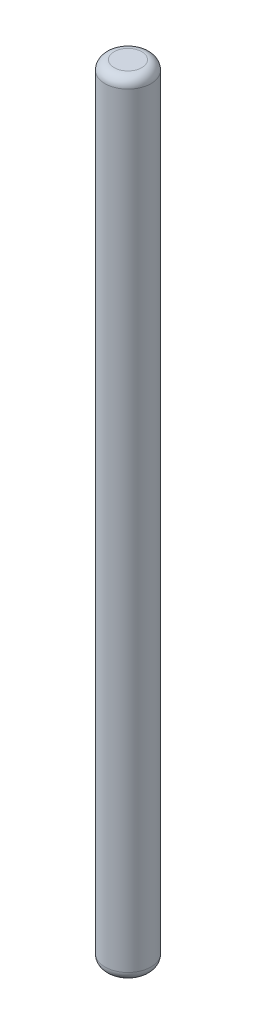
ISO-10303-21;
HEADER;
FILE_DESCRIPTION(('STEP AP214'),'2;1');
FILE_NAME('part.step','',(''),(''),'','','');
FILE_SCHEMA(('AUTOMOTIVE_DESIGN { 1 0 10303 214 1 1 1 1 }'));
ENDSEC;
DATA;
#1=APPLICATION_CONTEXT('core data for automotive mechanical design processes');
#2=APPLICATION_PROTOCOL_DEFINITION('international standard','automotive_design',2000,#1);
#3=PRODUCT_CONTEXT('',#1,'mechanical');
#4=PRODUCT('Part','Part','',(#3));
#5=PRODUCT_RELATED_PRODUCT_CATEGORY('part','',(#4));
#6=PRODUCT_DEFINITION_FORMATION('','',#4);
#7=PRODUCT_DEFINITION_CONTEXT('part definition',#1,'design');
#8=PRODUCT_DEFINITION('design','',#6,#7);
#9=PRODUCT_DEFINITION_SHAPE('','',#8);
#10=(LENGTH_UNIT() NAMED_UNIT(*) SI_UNIT(.MILLI.,.METRE.));
#11=(NAMED_UNIT(*) PLANE_ANGLE_UNIT() SI_UNIT($,.RADIAN.));
#12=(NAMED_UNIT(*) SI_UNIT($,.STERADIAN.) SOLID_ANGLE_UNIT());
#13=UNCERTAINTY_MEASURE_WITH_UNIT(LENGTH_MEASURE(1.E-05),#10,'distance_accuracy_value','');
#14=(GEOMETRIC_REPRESENTATION_CONTEXT(3) GLOBAL_UNCERTAINTY_ASSIGNED_CONTEXT((#13)) GLOBAL_UNIT_ASSIGNED_CONTEXT((#10,
#11,#12)) REPRESENTATION_CONTEXT('',''));
#15=CARTESIAN_POINT('',(0.,0.,0.));
#16=DIRECTION('',(0.,0.,1.));
#17=DIRECTION('',(1.,0.,0.));
#18=AXIS2_PLACEMENT_3D('',#15,#16,#17);
#19=CARTESIAN_POINT('',(0.0610619421206054,85.,-0.0610619421206095));
#20=DIRECTION('',(0.,-1.,0.));
#21=DIRECTION('',(0.,0.,-1.));
#22=AXIS2_PLACEMENT_3D('',#19,#20,#21);
#23=CYLINDRICAL_SURFACE('',#22,2.5);
#24=CARTESIAN_POINT('',(0.0610619421206054,1.,-0.0610619421206095));
#25=DIRECTION('',(0.,1.,0.));
#26=DIRECTION('',(0.,0.,1.));
#27=AXIS2_PLACEMENT_3D('',#24,#25,#26);
#28=CIRCLE('',#27,2.5);
#29=CARTESIAN_POINT('',(0.0610619421206054,1.,2.43893805787939));
#30=VERTEX_POINT('',#29);
#31=EDGE_CURVE('E44',#30,#30,#28,.T.);
#32=ORIENTED_EDGE('',*,*,#31,.T.);
#33=EDGE_LOOP('',(#32));
#34=FACE_BOUND('',#33,.T.);
#35=DIRECTION('',(0.,1.,0.));
#36=VECTOR('',#35,1.);
#37=CARTESIAN_POINT('',(1.1730828056927,60.,-2.30012638937986));
#38=LINE('',#37,#36);
#39=CARTESIAN_POINT('',(1.1730828056927,60.,-2.30012638937986));
#40=VERTEX_POINT('',#39);
#41=CARTESIAN_POINT('',(1.1730828056927,84.,-2.30012638937986));
#42=VERTEX_POINT('',#41);
#43=EDGE_CURVE('E76',#40,#42,#38,.T.);
#44=ORIENTED_EDGE('',*,*,#43,.T.);
#45=CARTESIAN_POINT('',(0.0610619421206054,84.,-0.0610619421206095));
#46=DIRECTION('',(0.,1.,0.));
#47=DIRECTION('',(0.,0.,1.));
#48=AXIS2_PLACEMENT_3D('',#45,#46,#47);
#49=CIRCLE('',#48,2.5);
#50=CARTESIAN_POINT('',(-1.0062591401267,84.,-2.32177548155687));
#51=VERTEX_POINT('',#50);
#52=EDGE_CURVE('E80',#42,#51,#49,.F.);
#53=ORIENTED_EDGE('',*,*,#52,.T.);
#54=DIRECTION('',(0.,1.,0.));
#55=VECTOR('',#54,1.);
#56=CARTESIAN_POINT('',(-1.0062591401267,60.,-2.32177548155687));
#57=LINE('',#56,#55);
#58=CARTESIAN_POINT('',(-1.0062591401267,60.,-2.32177548155687));
#59=VERTEX_POINT('',#58);
#60=EDGE_CURVE('E75',#59,#51,#57,.T.);
#61=ORIENTED_EDGE('',*,*,#60,.F.);
#62=CARTESIAN_POINT('',(0.0610619421206054,60.,-0.0610619421206095));
#63=DIRECTION('',(0.,1.,0.));
#64=DIRECTION('',(0.,0.,1.));
#65=AXIS2_PLACEMENT_3D('',#62,#63,#64);
#66=CIRCLE('',#65,2.5);
#67=EDGE_CURVE('E67',#40,#59,#66,.T.);
#68=ORIENTED_EDGE('',*,*,#67,.F.);
#69=EDGE_LOOP('',(#44,#53,#61,#68));
#70=FACE_BOUND('',#69,.T.);
#71=ADVANCED_FACE('F36',(#34,#70),#23,.T.);
#72=CARTESIAN_POINT('',(0.0610619421206054,85.,-0.0610619421206095));
#73=DIRECTION('',(0.,1.,0.));
#74=DIRECTION('',(0.,0.,1.));
#75=AXIS2_PLACEMENT_3D('',#72,#73,#74);
#76=PLANE('',#75);
#77=CARTESIAN_POINT('',(0.0610619421206054,85.,-0.0610619421206095));
#78=DIRECTION('',(0.,1.,0.));
#79=DIRECTION('',(0.,0.,1.));
#80=AXIS2_PLACEMENT_3D('',#77,#78,#79);
#81=CIRCLE('',#80,1.5);
#82=CARTESIAN_POINT('',(-0.57933070722778,85.,-1.41749006578237));
#83=VERTEX_POINT('',#82);
#84=EDGE_CURVE('E49',#83,#83,#81,.T.);
#85=ORIENTED_EDGE('',*,*,#84,.T.);
#86=EDGE_LOOP('',(#85));
#87=FACE_BOUND('',#86,.T.);
#88=ADVANCED_FACE('F99',(#87),#76,.T.);
#89=CARTESIAN_POINT('',(0.0610619421206054,0.,-0.0610619421206095));
#90=DIRECTION('',(0.,1.,0.));
#91=DIRECTION('',(0.,0.,1.));
#92=AXIS2_PLACEMENT_3D('',#89,#90,#91);
#93=PLANE('',#92);
#94=CARTESIAN_POINT('',(0.0610619421206054,0.,-0.0610619421206095));
#95=DIRECTION('',(0.,1.,0.));
#96=DIRECTION('',(0.,0.,1.));
#97=AXIS2_PLACEMENT_3D('',#94,#95,#96);
#98=CIRCLE('',#97,1.5);
#99=CARTESIAN_POINT('',(0.0610619421206054,0.,1.43893805787939));
#100=VERTEX_POINT('',#99);
#101=EDGE_CURVE('E11',#100,#100,#98,.F.);
#102=ORIENTED_EDGE('',*,*,#101,.T.);
#103=EDGE_LOOP('',(#102));
#104=FACE_BOUND('',#103,.T.);
#105=ADVANCED_FACE('F98',(#104),#93,.F.);
#106=CARTESIAN_POINT('',(-1.0062591401267,60.,-2.32177548155687));
#107=DIRECTION('',(-0.00993328473884208,0.,0.999950663710114));
#108=DIRECTION('',(0.999950663710114,0.,0.00993328473884209));
#109=AXIS2_PLACEMENT_3D('',#106,#107,#108);
#110=PLANE('',#109);
#111=ORIENTED_EDGE('',*,*,#60,.T.);
#112=CARTESIAN_POINT('',(-1.0062591401267,84.,-2.32177548155687));
#113=CARTESIAN_POINT('',(-1.00631033317868,84.0257499887344,-2.32177599009712));
#114=CARTESIAN_POINT('',(-1.0039810217002,84.0514506104348,-2.32175285124138));
#115=CARTESIAN_POINT('',(-0.994995752809504,84.1019040028832,-2.32166359360339));
#116=CARTESIAN_POINT('',(-0.988370552567407,84.1266621971751,-2.32159778035595));
#117=CARTESIAN_POINT('',(-0.97123444522594,84.1747163457058,-2.32142755412408));
#118=CARTESIAN_POINT('',(-0.960731452519259,84.1980151659547,-2.32132321975945));
#119=CARTESIAN_POINT('',(-0.93643118514888,84.2428520651656,-2.32108182637497));
#120=CARTESIAN_POINT('',(-0.922627961103178,84.2643868688766,-2.32094470825531));
#121=CARTESIAN_POINT('',(-0.885025735099742,84.315375503014,-2.32057117620892));
#122=CARTESIAN_POINT('',(-0.859615862734575,84.3436421887853,-2.32031876025828));
#123=CARTESIAN_POINT('',(-0.804620181817592,84.3957555623736,-2.31977244554718));
#124=CARTESIAN_POINT('',(-0.775025339542913,84.4195924233207,-2.31947845704776));
#125=CARTESIAN_POINT('',(-0.697051615138196,84.4743140168869,-2.31870388362652));
#126=CARTESIAN_POINT('',(-0.646822331847803,84.5025451452475,-2.31820491723622));
#127=CARTESIAN_POINT('',(-0.542704753328837,84.5510427446244,-2.31717063665491));
#128=CARTESIAN_POINT('',(-0.488809590600881,84.5712937556895,-2.3166352542437));
#129=CARTESIAN_POINT('',(-0.388965050704052,84.6020510013919,-2.31564342106592));
#130=CARTESIAN_POINT('',(-0.343344354841181,84.6136578492241,-2.31519023534543));
#131=CARTESIAN_POINT('',(-0.251258477705556,84.6329359116967,-2.31427547497653));
#132=CARTESIAN_POINT('',(-0.204792751425287,84.6406044858595,-2.31381389491414));
#133=CARTESIAN_POINT('',(-0.111260526632352,84.6523858278835,-2.31288476685329));
#134=CARTESIAN_POINT('',(-0.0641925183746456,84.6564863632128,-2.31241720385735));
#135=CARTESIAN_POINT('',(0.0301176718546658,84.6612889872444,-2.31148034766302));
#136=CARTESIAN_POINT('',(0.0773598700386019,84.6619907511926,-2.31101105430357));
#137=CARTESIAN_POINT('',(0.174380010781724,84.6599767382401,-2.31004727807103));
#138=CARTESIAN_POINT('',(0.224154175603773,84.6570704334021,-2.30955283272511));
#139=CARTESIAN_POINT('',(0.323352322361662,84.647351465898,-2.30856742067123));
#140=CARTESIAN_POINT('',(0.372776118911912,84.640536871771,-2.30807645580483));
#141=CARTESIAN_POINT('',(0.47057786253572,84.622679375656,-2.30710491530526));
#142=CARTESIAN_POINT('',(0.518960158491438,84.6116607368836,-2.30662429647126));
#143=CARTESIAN_POINT('',(0.614344556207763,84.5848282251451,-2.30567676934163));
#144=CARTESIAN_POINT('',(0.661348379537118,84.5690206395421,-2.30520984394432));
#145=CARTESIAN_POINT('',(0.746297075132156,84.5345904604404,-2.3043659827298));
#146=CARTESIAN_POINT('',(0.784549503808907,84.5167362593022,-2.30398599171645));
#147=CARTESIAN_POINT('',(0.858625892417835,84.4763674909329,-2.30325013355146));
#148=CARTESIAN_POINT('',(0.894446849196684,84.4538472948651,-2.30289429623247));
#149=CARTESIAN_POINT('',(0.962749795088704,84.4032426767613,-2.30221579014745));
#150=CARTESIAN_POINT('',(0.995180467613994,84.3750875735631,-2.30189363114885));
#151=CARTESIAN_POINT('',(1.05402687609467,84.3130730117989,-2.30130906417719));
#152=CARTESIAN_POINT('',(1.0804648667686,84.2792354991597,-2.30104643513076));
#153=CARTESIAN_POINT('',(1.11641536563521,84.2199676123323,-2.30068931096983));
#154=CARTESIAN_POINT('',(1.12855950645761,84.1961287340362,-2.30056867380935));
#155=CARTESIAN_POINT('',(1.14877396415882,84.1467957088242,-2.30036786793814));
#156=CARTESIAN_POINT('',(1.15685102246279,84.1213043806518,-2.30028763225963));
#157=CARTESIAN_POINT('',(1.16836614027504,84.0692250321703,-2.30017324367209));
#158=CARTESIAN_POINT('',(1.17179449404148,84.0426348364313,-2.30013918717772));
#159=CARTESIAN_POINT('',(1.17379424305161,83.9890823158577,-2.30011932212133));
#160=CARTESIAN_POINT('',(1.17232996673068,83.9621186915818,-2.30013386791259));
#161=CARTESIAN_POINT('',(1.1682988411613,83.9355095828083,-2.30017391220633));
#162=B_SPLINE_CURVE_WITH_KNOTS('',3,(#112,#113,#114,#115,#116,#117,#118,#119,#120,#121,#122,
#123,#124,#125,#126,#127,#128,#129,#130,#131,#132,#133,#134,#135,#136,#137,#138,#139,#140,#141,
#142,#143,#144,#145,#146,#147,#148,#149,#150,#151,#152,#153,#154,#155,#156,#157,#158,#159,#160,
#161),.UNSPECIFIED.,.F.,.F.,(4,2,2,2,2,2,2,2,2,2,2,2,2,2,2,2,2,2,2,2,2,2,2,2,4),(0.,
0.0770663904628506,0.153587013760128,0.229952317676831,0.306456338587907,0.419841634800272,
0.533475531886061,0.705377758784609,0.877611395112667,1.01865274467184,1.15978853457695,
1.30140630401216,1.44303760481443,1.59247647297903,1.74198925694611,1.89065188562409,
2.03912017620549,2.16550593351644,2.29204505376111,2.42028398886925,2.54803858884939,
2.62799249478937,2.70781343259864,2.78780076830566,2.86837255062909),.UNSPECIFIED.);
#163=EDGE_CURVE('E56',#51,#42,#162,.T.);
#164=ORIENTED_EDGE('',*,*,#163,.T.);
#165=ORIENTED_EDGE('',*,*,#43,.F.);
#166=DIRECTION('',(0.999950663710114,0.,0.00993328473884209));
#167=VECTOR('',#166,1.);
#168=CARTESIAN_POINT('',(-1.0062591401267,60.,-2.32177548155687));
#169=LINE('',#168,#167);
#170=EDGE_CURVE('E70',#59,#40,#169,.T.);
#171=ORIENTED_EDGE('',*,*,#170,.F.);
#172=EDGE_LOOP('',(#111,#164,#165,#171));
#173=FACE_BOUND('',#172,.T.);
#174=ADVANCED_FACE('F74',(#173),#110,.F.);
#175=CARTESIAN_POINT('',(0.0610619421206054,60.,-0.0610619421206095));
#176=DIRECTION('',(0.,1.,0.));
#177=DIRECTION('',(0.,0.,1.));
#178=AXIS2_PLACEMENT_3D('',#175,#176,#177);
#179=PLANE('',#178);
#180=ORIENTED_EDGE('',*,*,#67,.T.);
#181=ORIENTED_EDGE('',*,*,#170,.T.);
#182=EDGE_LOOP('',(#180,#181));
#183=FACE_BOUND('',#182,.T.);
#184=ADVANCED_FACE('F69',(#183),#179,.T.);
#185=CARTESIAN_POINT('',(0.0610619421206054,84.,-0.0610619421206095));
#186=DIRECTION('',(0.,1.,0.));
#187=DIRECTION('',(0.,0.,1.));
#188=AXIS2_PLACEMENT_3D('',#185,#186,#187);
#189=TOROIDAL_SURFACE('',#188,1.5,1.);
#190=ORIENTED_EDGE('',*,*,#163,.F.);
#191=ORIENTED_EDGE('',*,*,#52,.F.);
#192=EDGE_LOOP('',(#190,#191));
#193=FACE_BOUND('',#192,.T.);
#194=ORIENTED_EDGE('',*,*,#84,.F.);
#195=EDGE_LOOP('',(#194));
#196=FACE_BOUND('',#195,.T.);
#197=ADVANCED_FACE('F91',(#193,#196),#189,.T.);
#198=CARTESIAN_POINT('',(0.0610619421206054,1.,-0.0610619421206095));
#199=DIRECTION('',(0.,1.,0.));
#200=DIRECTION('',(0.,0.,1.));
#201=AXIS2_PLACEMENT_3D('',#198,#199,#200);
#202=TOROIDAL_SURFACE('',#201,1.5,1.);
#203=ORIENTED_EDGE('',*,*,#101,.F.);
#204=EDGE_LOOP('',(#203));
#205=FACE_BOUND('',#204,.T.);
#206=ORIENTED_EDGE('',*,*,#31,.F.);
#207=EDGE_LOOP('',(#206));
#208=FACE_BOUND('',#207,.T.);
#209=ADVANCED_FACE('F38',(#205,#208),#202,.T.);
#210=CLOSED_SHELL('',(#71,#88,#105,#174,#184,#197,#209));
#211=MANIFOLD_SOLID_BREP('B2',#210);
#212=ADVANCED_BREP_SHAPE_REPRESENTATION('',(#18,#211),#14);
#213=SHAPE_DEFINITION_REPRESENTATION(#9,#212);
ENDSEC;
END-ISO-10303-21;
